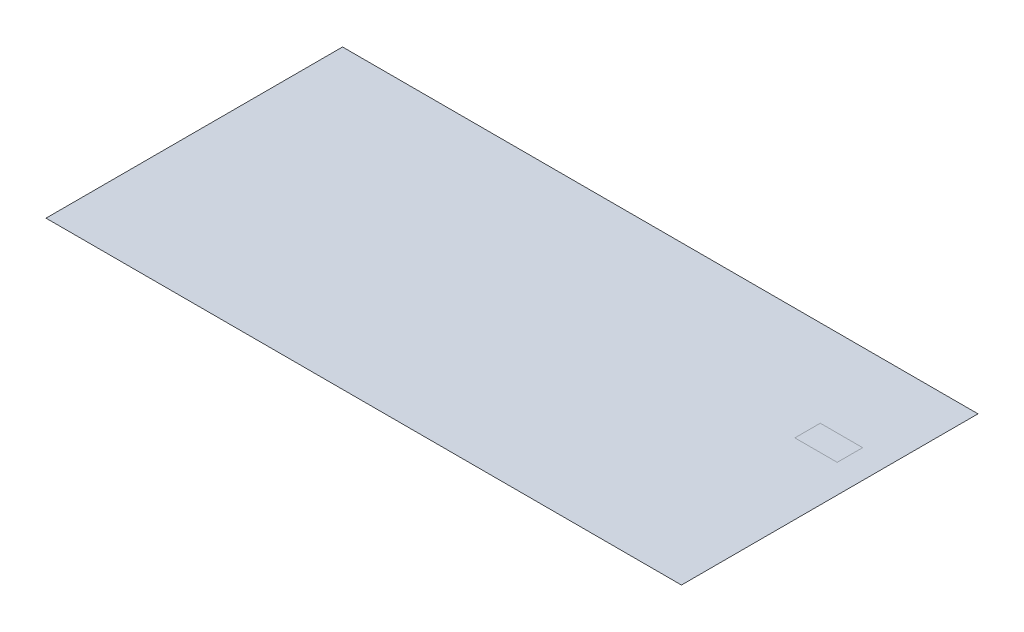
ISO-10303-21;
HEADER;
FILE_DESCRIPTION(('STEP AP214'),'2;1');
FILE_NAME('part.step','',(''),(''),'','','');
FILE_SCHEMA(('AUTOMOTIVE_DESIGN { 1 0 10303 214 1 1 1 1 }'));
ENDSEC;
DATA;
#1=APPLICATION_CONTEXT('core data for automotive mechanical design processes');
#2=APPLICATION_PROTOCOL_DEFINITION('international standard','automotive_design',2000,#1);
#3=PRODUCT_CONTEXT('',#1,'mechanical');
#4=PRODUCT('Part','Part','',(#3));
#5=PRODUCT_RELATED_PRODUCT_CATEGORY('part','',(#4));
#6=PRODUCT_DEFINITION_FORMATION('','',#4);
#7=PRODUCT_DEFINITION_CONTEXT('part definition',#1,'design');
#8=PRODUCT_DEFINITION('design','',#6,#7);
#9=PRODUCT_DEFINITION_SHAPE('','',#8);
#10=(LENGTH_UNIT() NAMED_UNIT(*) SI_UNIT(.MILLI.,.METRE.));
#11=(NAMED_UNIT(*) PLANE_ANGLE_UNIT() SI_UNIT($,.RADIAN.));
#12=(NAMED_UNIT(*) SI_UNIT($,.STERADIAN.) SOLID_ANGLE_UNIT());
#13=UNCERTAINTY_MEASURE_WITH_UNIT(LENGTH_MEASURE(1.E-05),#10,'distance_accuracy_value','');
#14=(GEOMETRIC_REPRESENTATION_CONTEXT(3) GLOBAL_UNCERTAINTY_ASSIGNED_CONTEXT((#13)) GLOBAL_UNIT_ASSIGNED_CONTEXT((#10,
#11,#12)) REPRESENTATION_CONTEXT('',''));
#15=CARTESIAN_POINT('',(0.,0.,0.));
#16=DIRECTION('',(0.,0.,1.));
#17=DIRECTION('',(1.,0.,0.));
#18=AXIS2_PLACEMENT_3D('',#15,#16,#17);
#19=CARTESIAN_POINT('',(0.,0.,0.));
#20=DIRECTION('',(0.,-1.,0.));
#21=DIRECTION('',(0.,0.,-1.));
#22=AXIS2_PLACEMENT_3D('',#19,#20,#21);
#23=PLANE('',#22);
#24=DIRECTION('',(-1.,0.,0.));
#25=VECTOR('',#24,1.);
#26=CARTESIAN_POINT('',(0.,0.,0.));
#27=LINE('',#26,#25);
#28=CARTESIAN_POINT('',(15000.,0.,0.));
#29=VERTEX_POINT('',#28);
#30=CARTESIAN_POINT('',(0.,0.,0.));
#31=VERTEX_POINT('',#30);
#32=EDGE_CURVE('E118',#29,#31,#27,.T.);
#33=ORIENTED_EDGE('',*,*,#32,.T.);
#34=DIRECTION('',(0.,0.,1.));
#35=VECTOR('',#34,1.);
#36=CARTESIAN_POINT('',(0.,0.,0.));
#37=LINE('',#36,#35);
#38=CARTESIAN_POINT('',(0.,0.,7000.));
#39=VERTEX_POINT('',#38);
#40=EDGE_CURVE('E91',#31,#39,#37,.T.);
#41=ORIENTED_EDGE('',*,*,#40,.T.);
#42=DIRECTION('',(1.,0.,0.));
#43=VECTOR('',#42,1.);
#44=CARTESIAN_POINT('',(15000.,0.,7000.));
#45=LINE('',#44,#43);
#46=CARTESIAN_POINT('',(15000.,0.,7000.));
#47=VERTEX_POINT('',#46);
#48=EDGE_CURVE('E113',#39,#47,#45,.T.);
#49=ORIENTED_EDGE('',*,*,#48,.T.);
#50=DIRECTION('',(0.,0.,-1.));
#51=VECTOR('',#50,1.);
#52=CARTESIAN_POINT('',(15000.,0.,0.));
#53=LINE('',#52,#51);
#54=EDGE_CURVE('E110',#47,#29,#53,.T.);
#55=ORIENTED_EDGE('',*,*,#54,.T.);
#56=EDGE_LOOP('',(#33,#41,#49,#55));
#57=FACE_BOUND('',#56,.T.);
#58=DIRECTION('',(-1.,0.,0.));
#59=VECTOR('',#58,1.);
#60=CARTESIAN_POINT('',(0.,0.,2053.));
#61=LINE('',#60,#59);
#62=CARTESIAN_POINT('',(14330.,0.,2053.));
#63=VERTEX_POINT('',#62);
#64=CARTESIAN_POINT('',(13330.,0.,2053.));
#65=VERTEX_POINT('',#64);
#66=EDGE_CURVE('E11',#63,#65,#61,.T.);
#67=ORIENTED_EDGE('',*,*,#66,.F.);
#68=DIRECTION('',(0.,0.,-1.));
#69=VECTOR('',#68,1.);
#70=CARTESIAN_POINT('',(14330.,0.,0.));
#71=LINE('',#70,#69);
#72=CARTESIAN_POINT('',(14330.,0.,2653.));
#73=VERTEX_POINT('',#72);
#74=EDGE_CURVE('E124',#73,#63,#71,.T.);
#75=ORIENTED_EDGE('',*,*,#74,.F.);
#76=DIRECTION('',(1.,0.,0.));
#77=VECTOR('',#76,1.);
#78=CARTESIAN_POINT('',(0.,0.,2653.));
#79=LINE('',#78,#77);
#80=CARTESIAN_POINT('',(13330.,0.,2653.));
#81=VERTEX_POINT('',#80);
#82=EDGE_CURVE('E130',#81,#73,#79,.T.);
#83=ORIENTED_EDGE('',*,*,#82,.F.);
#84=DIRECTION('',(0.,0.,1.));
#85=VECTOR('',#84,1.);
#86=CARTESIAN_POINT('',(13330.,0.,0.));
#87=LINE('',#86,#85);
#88=EDGE_CURVE('E46',#65,#81,#87,.T.);
#89=ORIENTED_EDGE('',*,*,#88,.F.);
#90=EDGE_LOOP('',(#67,#75,#83,#89));
#91=FACE_BOUND('',#90,.T.);
#92=ADVANCED_FACE('F37',(#57,#91),#23,.F.);
#93=CARTESIAN_POINT('',(0.,-0.001,0.));
#94=DIRECTION('',(0.,0.,-1.));
#95=DIRECTION('',(-1.,0.,0.));
#96=AXIS2_PLACEMENT_3D('',#93,#94,#95);
#97=PLANE('',#96);
#98=ORIENTED_EDGE('',*,*,#32,.F.);
#99=DIRECTION('',(0.,1.,0.));
#100=VECTOR('',#99,1.);
#101=CARTESIAN_POINT('',(15000.,-0.001,0.));
#102=LINE('',#101,#100);
#103=CARTESIAN_POINT('',(15000.,-0.001,0.));
#104=VERTEX_POINT('',#103);
#105=EDGE_CURVE('E109',#104,#29,#102,.T.);
#106=ORIENTED_EDGE('',*,*,#105,.F.);
#107=DIRECTION('',(-1.,0.,0.));
#108=VECTOR('',#107,1.);
#109=CARTESIAN_POINT('',(0.,-0.001,0.));
#110=LINE('',#109,#108);
#111=CARTESIAN_POINT('',(0.,-0.001,0.));
#112=VERTEX_POINT('',#111);
#113=EDGE_CURVE('E104',#104,#112,#110,.T.);
#114=ORIENTED_EDGE('',*,*,#113,.T.);
#115=DIRECTION('',(0.,1.,0.));
#116=VECTOR('',#115,1.);
#117=CARTESIAN_POINT('',(0.,-0.001,0.));
#118=LINE('',#117,#116);
#119=EDGE_CURVE('E86',#112,#31,#118,.T.);
#120=ORIENTED_EDGE('',*,*,#119,.T.);
#121=EDGE_LOOP('',(#98,#106,#114,#120));
#122=FACE_BOUND('',#121,.T.);
#123=ADVANCED_FACE('F39',(#122),#97,.T.);
#124=CARTESIAN_POINT('',(15000.,-0.001,0.));
#125=DIRECTION('',(1.,0.,0.));
#126=DIRECTION('',(0.,0.,-1.));
#127=AXIS2_PLACEMENT_3D('',#124,#125,#126);
#128=PLANE('',#127);
#129=ORIENTED_EDGE('',*,*,#54,.F.);
#130=DIRECTION('',(0.,1.,0.));
#131=VECTOR('',#130,1.);
#132=CARTESIAN_POINT('',(15000.,-0.001,7000.));
#133=LINE('',#132,#131);
#134=CARTESIAN_POINT('',(15000.,-0.001,7000.));
#135=VERTEX_POINT('',#134);
#136=EDGE_CURVE('E125',#135,#47,#133,.T.);
#137=ORIENTED_EDGE('',*,*,#136,.F.);
#138=DIRECTION('',(0.,0.,-1.));
#139=VECTOR('',#138,1.);
#140=CARTESIAN_POINT('',(15000.,-0.001,0.));
#141=LINE('',#140,#139);
#142=EDGE_CURVE('E97',#135,#104,#141,.T.);
#143=ORIENTED_EDGE('',*,*,#142,.T.);
#144=ORIENTED_EDGE('',*,*,#105,.T.);
#145=EDGE_LOOP('',(#129,#137,#143,#144));
#146=FACE_BOUND('',#145,.T.);
#147=ADVANCED_FACE('F152',(#146),#128,.T.);
#148=CARTESIAN_POINT('',(15000.,-0.001,7000.));
#149=DIRECTION('',(0.,0.,1.));
#150=DIRECTION('',(1.,0.,0.));
#151=AXIS2_PLACEMENT_3D('',#148,#149,#150);
#152=PLANE('',#151);
#153=ORIENTED_EDGE('',*,*,#48,.F.);
#154=DIRECTION('',(0.,1.,0.));
#155=VECTOR('',#154,1.);
#156=CARTESIAN_POINT('',(0.,-0.001,7000.));
#157=LINE('',#156,#155);
#158=CARTESIAN_POINT('',(0.,-0.001,7000.));
#159=VERTEX_POINT('',#158);
#160=EDGE_CURVE('E96',#159,#39,#157,.T.);
#161=ORIENTED_EDGE('',*,*,#160,.F.);
#162=DIRECTION('',(1.,0.,0.));
#163=VECTOR('',#162,1.);
#164=CARTESIAN_POINT('',(15000.,-0.001,7000.));
#165=LINE('',#164,#163);
#166=EDGE_CURVE('E107',#159,#135,#165,.T.);
#167=ORIENTED_EDGE('',*,*,#166,.T.);
#168=ORIENTED_EDGE('',*,*,#136,.T.);
#169=EDGE_LOOP('',(#153,#161,#167,#168));
#170=FACE_BOUND('',#169,.T.);
#171=ADVANCED_FACE('F161',(#170),#152,.T.);
#172=CARTESIAN_POINT('',(0.,-0.001,0.));
#173=DIRECTION('',(-1.,0.,0.));
#174=DIRECTION('',(0.,0.,1.));
#175=AXIS2_PLACEMENT_3D('',#172,#173,#174);
#176=PLANE('',#175);
#177=ORIENTED_EDGE('',*,*,#40,.F.);
#178=ORIENTED_EDGE('',*,*,#119,.F.);
#179=DIRECTION('',(0.,0.,1.));
#180=VECTOR('',#179,1.);
#181=CARTESIAN_POINT('',(0.,-0.001,0.));
#182=LINE('',#181,#180);
#183=EDGE_CURVE('E89',#112,#159,#182,.T.);
#184=ORIENTED_EDGE('',*,*,#183,.T.);
#185=ORIENTED_EDGE('',*,*,#160,.T.);
#186=EDGE_LOOP('',(#177,#178,#184,#185));
#187=FACE_BOUND('',#186,.T.);
#188=ADVANCED_FACE('F88',(#187),#176,.T.);
#189=CARTESIAN_POINT('',(0.,-0.001,0.));
#190=DIRECTION('',(0.,-1.,0.));
#191=DIRECTION('',(0.,0.,-1.));
#192=AXIS2_PLACEMENT_3D('',#189,#190,#191);
#193=PLANE('',#192);
#194=ORIENTED_EDGE('',*,*,#113,.F.);
#195=ORIENTED_EDGE('',*,*,#142,.F.);
#196=ORIENTED_EDGE('',*,*,#166,.F.);
#197=ORIENTED_EDGE('',*,*,#183,.F.);
#198=EDGE_LOOP('',(#194,#195,#196,#197));
#199=FACE_BOUND('',#198,.T.);
#200=ADVANCED_FACE('F102',(#199),#193,.T.);
#201=ORIENTED_EDGE('',*,*,#74,.T.);
#202=ORIENTED_EDGE('',*,*,#66,.T.);
#203=ORIENTED_EDGE('',*,*,#88,.T.);
#204=ORIENTED_EDGE('',*,*,#82,.T.);
#205=EDGE_LOOP('',(#201,#202,#203,#204));
#206=FACE_BOUND('',#205,.T.);
#207=ADVANCED_FACE('F142',(#206),#23,.F.);
#208=CLOSED_SHELL('',(#92,#123,#147,#171,#188,#200,#207));
#209=MANIFOLD_SOLID_BREP('B2',#208);
#210=ADVANCED_BREP_SHAPE_REPRESENTATION('',(#18,#209),#14);
#211=SHAPE_DEFINITION_REPRESENTATION(#9,#210);
ENDSEC;
END-ISO-10303-21;
